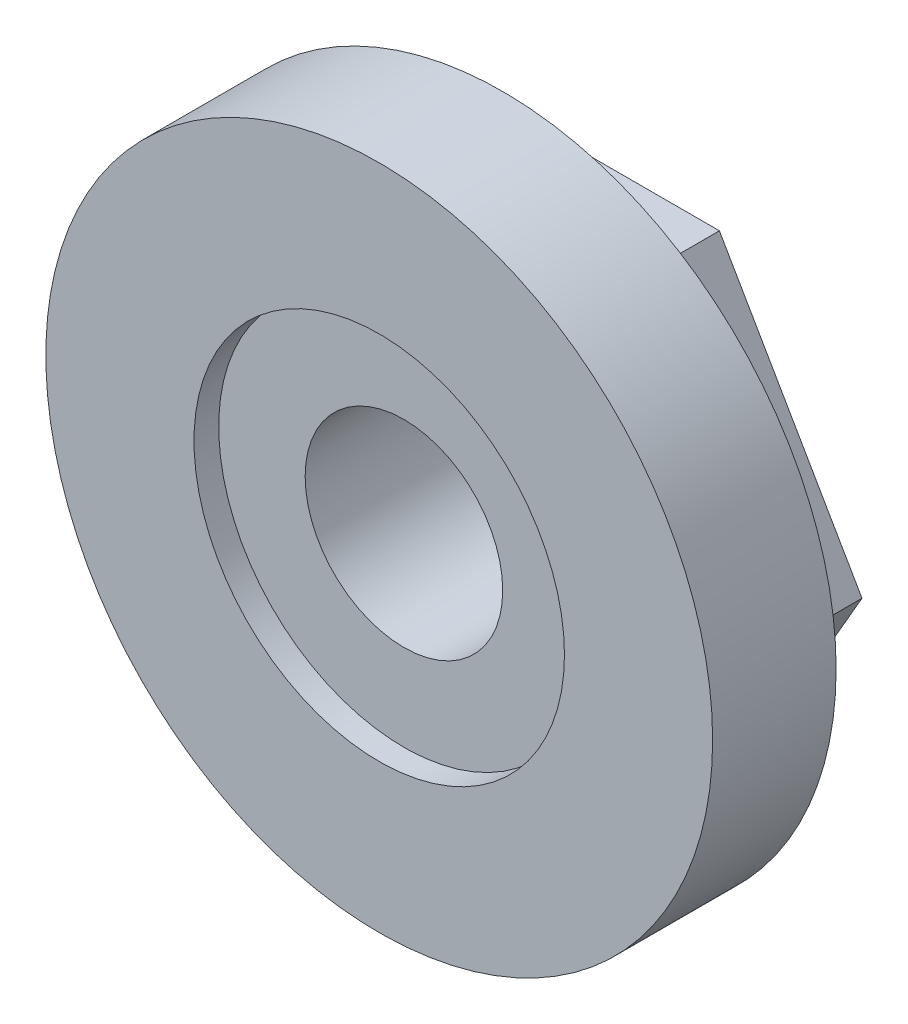
ISO-10303-21;
HEADER;
FILE_DESCRIPTION(('STEP AP214'),'2;1');
FILE_NAME('part.step','',(''),(''),'','','');
FILE_SCHEMA(('AUTOMOTIVE_DESIGN { 1 0 10303 214 1 1 1 1 }'));
ENDSEC;
DATA;
#1=APPLICATION_CONTEXT('core data for automotive mechanical design processes');
#2=APPLICATION_PROTOCOL_DEFINITION('international standard','automotive_design',2000,#1);
#3=PRODUCT_CONTEXT('',#1,'mechanical');
#4=PRODUCT('Part','Part','',(#3));
#5=PRODUCT_RELATED_PRODUCT_CATEGORY('part','',(#4));
#6=PRODUCT_DEFINITION_FORMATION('','',#4);
#7=PRODUCT_DEFINITION_CONTEXT('part definition',#1,'design');
#8=PRODUCT_DEFINITION('design','',#6,#7);
#9=PRODUCT_DEFINITION_SHAPE('','',#8);
#10=(LENGTH_UNIT() NAMED_UNIT(*) SI_UNIT(.MILLI.,.METRE.));
#11=(NAMED_UNIT(*) PLANE_ANGLE_UNIT() SI_UNIT($,.RADIAN.));
#12=(NAMED_UNIT(*) SI_UNIT($,.STERADIAN.) SOLID_ANGLE_UNIT());
#13=UNCERTAINTY_MEASURE_WITH_UNIT(LENGTH_MEASURE(1.E-05),#10,'distance_accuracy_value','');
#14=(GEOMETRIC_REPRESENTATION_CONTEXT(3) GLOBAL_UNCERTAINTY_ASSIGNED_CONTEXT((#13)) GLOBAL_UNIT_ASSIGNED_CONTEXT((#10,
#11,#12)) REPRESENTATION_CONTEXT('',''));
#15=CARTESIAN_POINT('',(0.,0.,0.));
#16=DIRECTION('',(0.,0.,1.));
#17=DIRECTION('',(1.,0.,0.));
#18=AXIS2_PLACEMENT_3D('',#15,#16,#17);
#19=CARTESIAN_POINT('',(-5.77350269189625,-10.,3.));
#20=DIRECTION('',(0.,1.,0.));
#21=DIRECTION('',(0.,0.,1.));
#22=AXIS2_PLACEMENT_3D('',#19,#20,#21);
#23=PLANE('',#22);
#24=DIRECTION('',(1.,0.,0.));
#25=VECTOR('',#24,1.);
#26=CARTESIAN_POINT('',(-5.77350269189625,-10.,0.));
#27=LINE('',#26,#25);
#28=CARTESIAN_POINT('',(-5.77350269189625,-10.,0.));
#29=VERTEX_POINT('',#28);
#30=CARTESIAN_POINT('',(5.77350269189626,-10.,0.));
#31=VERTEX_POINT('',#30);
#32=EDGE_CURVE('E125',#29,#31,#27,.T.);
#33=ORIENTED_EDGE('',*,*,#32,.T.);
#34=DIRECTION('',(0.,0.,-1.));
#35=VECTOR('',#34,1.);
#36=CARTESIAN_POINT('',(5.77350269189626,-10.,3.));
#37=LINE('',#36,#35);
#38=CARTESIAN_POINT('',(5.77350269189626,-10.,3.));
#39=VERTEX_POINT('',#38);
#40=EDGE_CURVE('E11',#39,#31,#37,.T.);
#41=ORIENTED_EDGE('',*,*,#40,.F.);
#42=DIRECTION('',(1.,0.,0.));
#43=VECTOR('',#42,1.);
#44=CARTESIAN_POINT('',(-5.77350269189625,-10.,3.));
#45=LINE('',#44,#43);
#46=CARTESIAN_POINT('',(-5.77350269189625,-10.,3.));
#47=VERTEX_POINT('',#46);
#48=EDGE_CURVE('E117',#47,#39,#45,.T.);
#49=ORIENTED_EDGE('',*,*,#48,.F.);
#50=DIRECTION('',(0.,0.,-1.));
#51=VECTOR('',#50,1.);
#52=CARTESIAN_POINT('',(-5.77350269189625,-10.,3.));
#53=LINE('',#52,#51);
#54=EDGE_CURVE('E124',#47,#29,#53,.T.);
#55=ORIENTED_EDGE('',*,*,#54,.T.);
#56=EDGE_LOOP('',(#33,#41,#49,#55));
#57=FACE_BOUND('',#56,.T.);
#58=ADVANCED_FACE('F33',(#57),#23,.F.);
#59=CARTESIAN_POINT('',(5.77350269189626,-10.,3.));
#60=DIRECTION('',(-0.866025403784439,0.5,0.));
#61=DIRECTION('',(-0.5,-0.866025403784439,0.));
#62=AXIS2_PLACEMENT_3D('',#59,#60,#61);
#63=PLANE('',#62);
#64=DIRECTION('',(0.5,0.866025403784439,0.));
#65=VECTOR('',#64,1.);
#66=CARTESIAN_POINT('',(5.77350269189626,-10.,0.));
#67=LINE('',#66,#65);
#68=CARTESIAN_POINT('',(11.5470053837925,0.,0.));
#69=VERTEX_POINT('',#68);
#70=EDGE_CURVE('E128',#31,#69,#67,.T.);
#71=ORIENTED_EDGE('',*,*,#70,.T.);
#72=DIRECTION('',(0.,0.,-1.));
#73=VECTOR('',#72,1.);
#74=CARTESIAN_POINT('',(11.5470053837925,0.,3.));
#75=LINE('',#74,#73);
#76=CARTESIAN_POINT('',(11.5470053837925,0.,3.));
#77=VERTEX_POINT('',#76);
#78=EDGE_CURVE('E42',#77,#69,#75,.T.);
#79=ORIENTED_EDGE('',*,*,#78,.F.);
#80=DIRECTION('',(0.5,0.866025403784439,0.));
#81=VECTOR('',#80,1.);
#82=CARTESIAN_POINT('',(5.77350269189626,-10.,3.));
#83=LINE('',#82,#81);
#84=EDGE_CURVE('E86',#39,#77,#83,.T.);
#85=ORIENTED_EDGE('',*,*,#84,.F.);
#86=ORIENTED_EDGE('',*,*,#40,.T.);
#87=EDGE_LOOP('',(#71,#79,#85,#86));
#88=FACE_BOUND('',#87,.T.);
#89=ADVANCED_FACE('F199',(#88),#63,.F.);
#90=CARTESIAN_POINT('',(11.5470053837925,0.,3.));
#91=DIRECTION('',(-0.866025403784438,-0.5,0.));
#92=DIRECTION('',(0.5,-0.866025403784438,0.));
#93=AXIS2_PLACEMENT_3D('',#90,#91,#92);
#94=PLANE('',#93);
#95=DIRECTION('',(-0.5,0.866025403784438,0.));
#96=VECTOR('',#95,1.);
#97=CARTESIAN_POINT('',(11.5470053837925,0.,0.));
#98=LINE('',#97,#96);
#99=CARTESIAN_POINT('',(5.77350269189625,10.,0.));
#100=VERTEX_POINT('',#99);
#101=EDGE_CURVE('E101',#69,#100,#98,.T.);
#102=ORIENTED_EDGE('',*,*,#101,.T.);
#103=DIRECTION('',(0.,0.,-1.));
#104=VECTOR('',#103,1.);
#105=CARTESIAN_POINT('',(5.77350269189625,10.,3.));
#106=LINE('',#105,#104);
#107=CARTESIAN_POINT('',(5.77350269189625,10.,3.));
#108=VERTEX_POINT('',#107);
#109=EDGE_CURVE('E94',#108,#100,#106,.T.);
#110=ORIENTED_EDGE('',*,*,#109,.F.);
#111=DIRECTION('',(-0.5,0.866025403784438,0.));
#112=VECTOR('',#111,1.);
#113=CARTESIAN_POINT('',(11.5470053837925,0.,3.));
#114=LINE('',#113,#112);
#115=EDGE_CURVE('E99',#77,#108,#114,.T.);
#116=ORIENTED_EDGE('',*,*,#115,.F.);
#117=ORIENTED_EDGE('',*,*,#78,.T.);
#118=EDGE_LOOP('',(#102,#110,#116,#117));
#119=FACE_BOUND('',#118,.T.);
#120=ADVANCED_FACE('F96',(#119),#94,.F.);
#121=CARTESIAN_POINT('',(5.77350269189625,10.,3.));
#122=DIRECTION('',(0.,-1.,0.));
#123=DIRECTION('',(1.,0.,0.));
#124=AXIS2_PLACEMENT_3D('',#121,#122,#123);
#125=PLANE('',#124);
#126=DIRECTION('',(-1.,0.,0.));
#127=VECTOR('',#126,1.);
#128=CARTESIAN_POINT('',(5.77350269189625,10.,0.));
#129=LINE('',#128,#127);
#130=CARTESIAN_POINT('',(-5.77350269189625,10.,0.));
#131=VERTEX_POINT('',#130);
#132=EDGE_CURVE('E132',#100,#131,#129,.T.);
#133=ORIENTED_EDGE('',*,*,#132,.T.);
#134=DIRECTION('',(0.,0.,-1.));
#135=VECTOR('',#134,1.);
#136=CARTESIAN_POINT('',(-5.77350269189625,10.,3.));
#137=LINE('',#136,#135);
#138=CARTESIAN_POINT('',(-5.77350269189625,10.,3.));
#139=VERTEX_POINT('',#138);
#140=EDGE_CURVE('E104',#139,#131,#137,.T.);
#141=ORIENTED_EDGE('',*,*,#140,.F.);
#142=DIRECTION('',(-1.,0.,0.));
#143=VECTOR('',#142,1.);
#144=CARTESIAN_POINT('',(5.77350269189625,10.,3.));
#145=LINE('',#144,#143);
#146=EDGE_CURVE('E107',#108,#139,#145,.T.);
#147=ORIENTED_EDGE('',*,*,#146,.F.);
#148=ORIENTED_EDGE('',*,*,#109,.T.);
#149=EDGE_LOOP('',(#133,#141,#147,#148));
#150=FACE_BOUND('',#149,.T.);
#151=ADVANCED_FACE('F108',(#150),#125,.F.);
#152=CARTESIAN_POINT('',(-5.77350269189625,10.,3.));
#153=DIRECTION('',(0.866025403784439,-0.5,0.));
#154=DIRECTION('',(0.5,0.866025403784439,0.));
#155=AXIS2_PLACEMENT_3D('',#152,#153,#154);
#156=PLANE('',#155);
#157=DIRECTION('',(-0.5,-0.866025403784438,0.));
#158=VECTOR('',#157,1.);
#159=CARTESIAN_POINT('',(-5.77350269189625,10.,0.));
#160=LINE('',#159,#158);
#161=CARTESIAN_POINT('',(-11.5470053837925,0.,0.));
#162=VERTEX_POINT('',#161);
#163=EDGE_CURVE('E72',#131,#162,#160,.T.);
#164=ORIENTED_EDGE('',*,*,#163,.T.);
#165=DIRECTION('',(0.,0.,-1.));
#166=VECTOR('',#165,1.);
#167=CARTESIAN_POINT('',(-11.5470053837925,0.,3.));
#168=LINE('',#167,#166);
#169=CARTESIAN_POINT('',(-11.5470053837925,0.,3.));
#170=VERTEX_POINT('',#169);
#171=EDGE_CURVE('E50',#170,#162,#168,.T.);
#172=ORIENTED_EDGE('',*,*,#171,.F.);
#173=DIRECTION('',(-0.5,-0.866025403784438,0.));
#174=VECTOR('',#173,1.);
#175=CARTESIAN_POINT('',(-5.77350269189625,10.,3.));
#176=LINE('',#175,#174);
#177=EDGE_CURVE('E111',#139,#170,#176,.T.);
#178=ORIENTED_EDGE('',*,*,#177,.F.);
#179=ORIENTED_EDGE('',*,*,#140,.T.);
#180=EDGE_LOOP('',(#164,#172,#178,#179));
#181=FACE_BOUND('',#180,.T.);
#182=ADVANCED_FACE('F142',(#181),#156,.F.);
#183=CARTESIAN_POINT('',(-11.5470053837925,0.,3.));
#184=DIRECTION('',(0.866025403784438,0.5,0.));
#185=DIRECTION('',(-0.5,0.866025403784439,0.));
#186=AXIS2_PLACEMENT_3D('',#183,#184,#185);
#187=PLANE('',#186);
#188=DIRECTION('',(0.5,-0.866025403784439,0.));
#189=VECTOR('',#188,1.);
#190=CARTESIAN_POINT('',(-11.5470053837925,0.,0.));
#191=LINE('',#190,#189);
#192=EDGE_CURVE('E78',#162,#29,#191,.T.);
#193=ORIENTED_EDGE('',*,*,#192,.T.);
#194=ORIENTED_EDGE('',*,*,#54,.F.);
#195=DIRECTION('',(0.5,-0.866025403784439,0.));
#196=VECTOR('',#195,1.);
#197=CARTESIAN_POINT('',(-11.5470053837925,0.,3.));
#198=LINE('',#197,#196);
#199=EDGE_CURVE('E122',#170,#47,#198,.T.);
#200=ORIENTED_EDGE('',*,*,#199,.F.);
#201=ORIENTED_EDGE('',*,*,#171,.T.);
#202=EDGE_LOOP('',(#193,#194,#200,#201));
#203=FACE_BOUND('',#202,.T.);
#204=ADVANCED_FACE('F144',(#203),#187,.F.);
#205=CARTESIAN_POINT('',(0.,0.,0.));
#206=DIRECTION('',(0.,0.,1.));
#207=DIRECTION('',(1.,0.,0.));
#208=AXIS2_PLACEMENT_3D('',#205,#206,#207);
#209=PLANE('',#208);
#210=CARTESIAN_POINT('',(0.,0.,0.));
#211=DIRECTION('',(0.,0.,-1.));
#212=DIRECTION('',(-1.,0.,0.));
#213=AXIS2_PLACEMENT_3D('',#210,#211,#212);
#214=CIRCLE('',#213,4.);
#215=CARTESIAN_POINT('',(-4.,0.,0.));
#216=VERTEX_POINT('',#215);
#217=EDGE_CURVE('E158',#216,#216,#214,.T.);
#218=ORIENTED_EDGE('',*,*,#217,.F.);
#219=EDGE_LOOP('',(#218));
#220=FACE_BOUND('',#219,.T.);
#221=ORIENTED_EDGE('',*,*,#32,.F.);
#222=ORIENTED_EDGE('',*,*,#192,.F.);
#223=ORIENTED_EDGE('',*,*,#163,.F.);
#224=ORIENTED_EDGE('',*,*,#132,.F.);
#225=ORIENTED_EDGE('',*,*,#101,.F.);
#226=ORIENTED_EDGE('',*,*,#70,.F.);
#227=EDGE_LOOP('',(#221,#222,#223,#224,#225,#226));
#228=FACE_BOUND('',#227,.T.);
#229=ADVANCED_FACE('F141',(#220,#228),#209,.F.);
#230=CARTESIAN_POINT('',(0.,0.,3.));
#231=DIRECTION('',(0.,0.,1.));
#232=DIRECTION('',(1.,0.,0.));
#233=AXIS2_PLACEMENT_3D('',#230,#231,#232);
#234=PLANE('',#233);
#235=CARTESIAN_POINT('',(0.,0.,3.));
#236=DIRECTION('',(0.,0.,1.));
#237=DIRECTION('',(1.,0.,0.));
#238=AXIS2_PLACEMENT_3D('',#235,#236,#237);
#239=CIRCLE('',#238,13.5);
#240=CARTESIAN_POINT('',(13.5,0.,3.));
#241=VERTEX_POINT('',#240);
#242=EDGE_CURVE('E147',#241,#241,#239,.T.);
#243=ORIENTED_EDGE('',*,*,#242,.F.);
#244=EDGE_LOOP('',(#243));
#245=FACE_BOUND('',#244,.T.);
#246=ORIENTED_EDGE('',*,*,#199,.T.);
#247=ORIENTED_EDGE('',*,*,#48,.T.);
#248=ORIENTED_EDGE('',*,*,#84,.T.);
#249=ORIENTED_EDGE('',*,*,#115,.T.);
#250=ORIENTED_EDGE('',*,*,#146,.T.);
#251=ORIENTED_EDGE('',*,*,#177,.T.);
#252=EDGE_LOOP('',(#246,#247,#248,#249,#250,#251));
#253=FACE_BOUND('',#252,.T.);
#254=ADVANCED_FACE('F114',(#245,#253),#234,.F.);
#255=CARTESIAN_POINT('',(0.,0.,8.));
#256=DIRECTION('',(0.,0.,-1.));
#257=DIRECTION('',(-1.,0.,0.));
#258=AXIS2_PLACEMENT_3D('',#255,#256,#257);
#259=CYLINDRICAL_SURFACE('',#258,13.5);
#260=CARTESIAN_POINT('',(0.,0.,8.));
#261=DIRECTION('',(0.,0.,1.));
#262=DIRECTION('',(1.,0.,0.));
#263=AXIS2_PLACEMENT_3D('',#260,#261,#262);
#264=CIRCLE('',#263,13.5);
#265=CARTESIAN_POINT('',(13.5,0.,8.));
#266=VERTEX_POINT('',#265);
#267=EDGE_CURVE('E129',#266,#266,#264,.T.);
#268=ORIENTED_EDGE('',*,*,#267,.F.);
#269=EDGE_LOOP('',(#268));
#270=FACE_BOUND('',#269,.T.);
#271=ORIENTED_EDGE('',*,*,#242,.T.);
#272=EDGE_LOOP('',(#271));
#273=FACE_BOUND('',#272,.T.);
#274=ADVANCED_FACE('F182',(#270,#273),#259,.T.);
#275=CARTESIAN_POINT('',(0.,0.,8.));
#276=DIRECTION('',(0.,0.,1.));
#277=DIRECTION('',(1.,0.,0.));
#278=AXIS2_PLACEMENT_3D('',#275,#276,#277);
#279=PLANE('',#278);
#280=CARTESIAN_POINT('',(0.,0.,8.));
#281=DIRECTION('',(0.,0.,1.));
#282=DIRECTION('',(1.,0.,0.));
#283=AXIS2_PLACEMENT_3D('',#280,#281,#282);
#284=CIRCLE('',#283,7.5);
#285=CARTESIAN_POINT('',(7.5,0.,8.));
#286=VERTEX_POINT('',#285);
#287=EDGE_CURVE('E153',#286,#286,#284,.T.);
#288=ORIENTED_EDGE('',*,*,#287,.F.);
#289=EDGE_LOOP('',(#288));
#290=FACE_BOUND('',#289,.T.);
#291=ORIENTED_EDGE('',*,*,#267,.T.);
#292=EDGE_LOOP('',(#291));
#293=FACE_BOUND('',#292,.T.);
#294=ADVANCED_FACE('F176',(#290,#293),#279,.T.);
#295=CARTESIAN_POINT('',(0.,0.,7.));
#296=DIRECTION('',(0.,0.,1.));
#297=DIRECTION('',(1.,0.,0.));
#298=AXIS2_PLACEMENT_3D('',#295,#296,#297);
#299=CYLINDRICAL_SURFACE('',#298,7.5);
#300=CARTESIAN_POINT('',(0.,0.,7.));
#301=DIRECTION('',(0.,0.,1.));
#302=DIRECTION('',(1.,0.,0.));
#303=AXIS2_PLACEMENT_3D('',#300,#301,#302);
#304=CIRCLE('',#303,7.5);
#305=CARTESIAN_POINT('',(7.5,0.,7.));
#306=VERTEX_POINT('',#305);
#307=EDGE_CURVE('E150',#306,#306,#304,.T.);
#308=ORIENTED_EDGE('',*,*,#307,.F.);
#309=EDGE_LOOP('',(#308));
#310=FACE_BOUND('',#309,.T.);
#311=ORIENTED_EDGE('',*,*,#287,.T.);
#312=EDGE_LOOP('',(#311));
#313=FACE_BOUND('',#312,.T.);
#314=ADVANCED_FACE('F170',(#310,#313),#299,.F.);
#315=CARTESIAN_POINT('',(0.,0.,7.));
#316=DIRECTION('',(0.,0.,1.));
#317=DIRECTION('',(1.,0.,0.));
#318=AXIS2_PLACEMENT_3D('',#315,#316,#317);
#319=PLANE('',#318);
#320=CARTESIAN_POINT('',(0.,0.,7.));
#321=DIRECTION('',(0.,0.,1.));
#322=DIRECTION('',(1.,0.,0.));
#323=AXIS2_PLACEMENT_3D('',#320,#321,#322);
#324=CIRCLE('',#323,4.);
#325=CARTESIAN_POINT('',(4.,0.,7.));
#326=VERTEX_POINT('',#325);
#327=EDGE_CURVE('E36',#326,#326,#324,.T.);
#328=ORIENTED_EDGE('',*,*,#327,.F.);
#329=EDGE_LOOP('',(#328));
#330=FACE_BOUND('',#329,.T.);
#331=ORIENTED_EDGE('',*,*,#307,.T.);
#332=EDGE_LOOP('',(#331));
#333=FACE_BOUND('',#332,.T.);
#334=ADVANCED_FACE('F167',(#330,#333),#319,.T.);
#335=CARTESIAN_POINT('',(0.,0.,8.));
#336=DIRECTION('',(0.,0.,-1.));
#337=DIRECTION('',(-1.,0.,0.));
#338=AXIS2_PLACEMENT_3D('',#335,#336,#337);
#339=CYLINDRICAL_SURFACE('',#338,4.);
#340=ORIENTED_EDGE('',*,*,#327,.T.);
#341=EDGE_LOOP('',(#340));
#342=FACE_BOUND('',#341,.T.);
#343=ORIENTED_EDGE('',*,*,#217,.T.);
#344=EDGE_LOOP('',(#343));
#345=FACE_BOUND('',#344,.T.);
#346=ADVANCED_FACE('F165',(#342,#345),#339,.F.);
#347=CLOSED_SHELL('',(#58,#89,#120,#151,#182,#204,#229,#254,#274,#294,#314,#334,#346));
#348=MANIFOLD_SOLID_BREP('B2',#347);
#349=ADVANCED_BREP_SHAPE_REPRESENTATION('',(#18,#348),#14);
#350=SHAPE_DEFINITION_REPRESENTATION(#9,#349);
ENDSEC;
END-ISO-10303-21;
